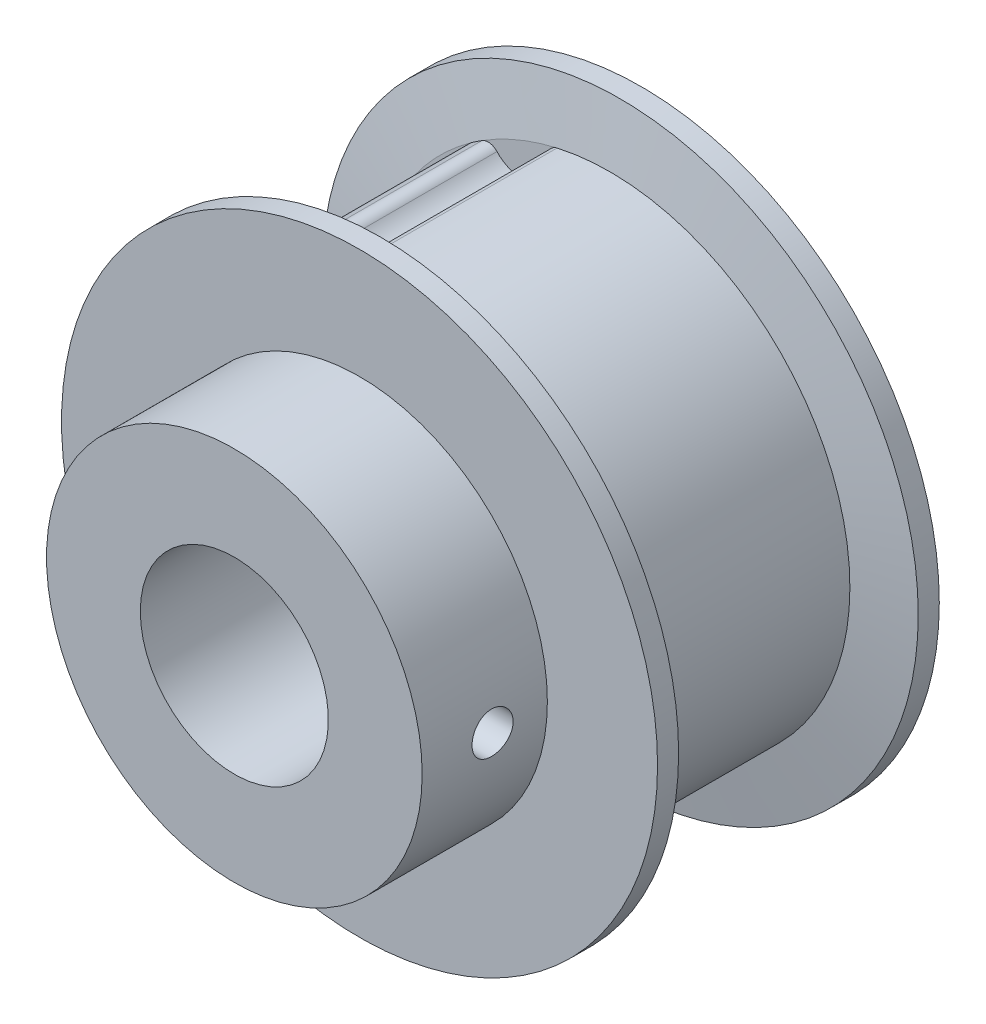
ISO-10303-21;
HEADER;
FILE_DESCRIPTION(('STEP AP214'),'2;1');
FILE_NAME('part.step','',(''),(''),'','','');
FILE_SCHEMA(('AUTOMOTIVE_DESIGN { 1 0 10303 214 1 1 1 1 }'));
ENDSEC;
DATA;
#1=APPLICATION_CONTEXT('core data for automotive mechanical design processes');
#2=APPLICATION_PROTOCOL_DEFINITION('international standard','automotive_design',2000,#1);
#3=PRODUCT_CONTEXT('',#1,'mechanical');
#4=PRODUCT('Part','Part','',(#3));
#5=PRODUCT_RELATED_PRODUCT_CATEGORY('part','',(#4));
#6=PRODUCT_DEFINITION_FORMATION('','',#4);
#7=PRODUCT_DEFINITION_CONTEXT('part definition',#1,'design');
#8=PRODUCT_DEFINITION('design','',#6,#7);
#9=PRODUCT_DEFINITION_SHAPE('','',#8);
#10=(LENGTH_UNIT() NAMED_UNIT(*) SI_UNIT(.MILLI.,.METRE.));
#11=(NAMED_UNIT(*) PLANE_ANGLE_UNIT() SI_UNIT($,.RADIAN.));
#12=(NAMED_UNIT(*) SI_UNIT($,.STERADIAN.) SOLID_ANGLE_UNIT());
#13=UNCERTAINTY_MEASURE_WITH_UNIT(LENGTH_MEASURE(1.E-05),#10,'distance_accuracy_value','');
#14=(GEOMETRIC_REPRESENTATION_CONTEXT(3) GLOBAL_UNCERTAINTY_ASSIGNED_CONTEXT((#13)) GLOBAL_UNIT_ASSIGNED_CONTEXT((#10,
#11,#12)) REPRESENTATION_CONTEXT('',''));
#15=CARTESIAN_POINT('',(0.,0.,0.));
#16=DIRECTION('',(0.,0.,1.));
#17=DIRECTION('',(1.,0.,0.));
#18=AXIS2_PLACEMENT_3D('',#15,#16,#17);
#19=CARTESIAN_POINT('',(0.,0.,13.49375));
#20=DIRECTION('',(0.,0.,1.));
#21=DIRECTION('',(1.,0.,0.));
#22=AXIS2_PLACEMENT_3D('',#19,#20,#21);
#23=PLANE('',#22);
#24=CARTESIAN_POINT('',(0.,0.,13.49375));
#25=DIRECTION('',(0.,0.,-1.));
#26=DIRECTION('',(-1.,0.,0.));
#27=AXIS2_PLACEMENT_3D('',#24,#25,#26);
#28=CIRCLE('',#27,4.76885);
#29=CARTESIAN_POINT('',(-4.76885,0.,13.49375));
#30=VERTEX_POINT('',#29);
#31=EDGE_CURVE('E430',#30,#30,#28,.T.);
#32=ORIENTED_EDGE('',*,*,#31,.T.);
#33=EDGE_LOOP('',(#32));
#34=FACE_BOUND('',#33,.T.);
#35=CARTESIAN_POINT('',(0.,0.,13.49375));
#36=DIRECTION('',(0.,0.,1.));
#37=DIRECTION('',(1.,0.,0.));
#38=AXIS2_PLACEMENT_3D('',#35,#36,#37);
#39=CIRCLE('',#38,9.525);
#40=CARTESIAN_POINT('',(9.525,0.,13.49375));
#41=VERTEX_POINT('',#40);
#42=EDGE_CURVE('E257',#41,#41,#39,.F.);
#43=ORIENTED_EDGE('',*,*,#42,.F.);
#44=EDGE_LOOP('',(#43));
#45=FACE_BOUND('',#44,.T.);
#46=ADVANCED_FACE('F16',(#34,#45),#23,.T.);
#47=CARTESIAN_POINT('',(0.,0.,9.921875));
#48=DIRECTION('',(-1.,0.,0.));
#49=DIRECTION('',(0.,0.,1.));
#50=AXIS2_PLACEMENT_3D('',#47,#48,#49);
#51=CYLINDRICAL_SURFACE('',#50,1.0414);
#52=CARTESIAN_POINT('',(4.76885,0.,8.880475));
#53=CARTESIAN_POINT('',(4.76884852330847,-0.0576985977662349,8.88047783334648));
#54=CARTESIAN_POINT('',(4.76779113617703,-0.115467533123418,8.88529102624313));
#55=CARTESIAN_POINT('',(4.7636714430234,-0.229412794410988,8.90441091337079));
#56=CARTESIAN_POINT('',(4.76060523450025,-0.285585797876013,8.91873608708849));
#57=CARTESIAN_POINT('',(4.7528096560498,-0.394604188509253,8.95641099825753));
#58=CARTESIAN_POINT('',(4.74808281450999,-0.447454491220938,8.97974702161308));
#59=CARTESIAN_POINT('',(4.73747744549021,-0.548471129240607,9.03474411265659));
#60=CARTESIAN_POINT('',(4.73159927002114,-0.596638889479045,9.06640263681796));
#61=CARTESIAN_POINT('',(4.71922840595486,-0.687720111083311,9.13768932718942));
#62=CARTESIAN_POINT('',(4.71272806419331,-0.730547577913806,9.17742605747561));
#63=CARTESIAN_POINT('',(4.69989922363985,-0.808987687584566,9.26350998249827));
#64=CARTESIAN_POINT('',(4.69357074951007,-0.844599299674293,9.30985812003383));
#65=CARTESIAN_POINT('',(4.68172784625236,-0.907969596174088,9.40847706791252));
#66=CARTESIAN_POINT('',(4.6762231292802,-0.935637662620655,9.46080737794415));
#67=CARTESIAN_POINT('',(4.66675985238805,-0.9817538722819,9.56951435714228));
#68=CARTESIAN_POINT('',(4.66280109547798,-1.00020319025624,9.62589050969306));
#69=CARTESIAN_POINT('',(4.6569552161561,-1.02707665450748,9.74016386018618));
#70=CARTESIAN_POINT('',(4.65503691801135,-1.03565183848001,9.79802390989361));
#71=CARTESIAN_POINT('',(4.65339551770343,-1.04300323002775,9.91439084590502));
#72=CARTESIAN_POINT('',(4.6536721497645,-1.04178062397998,9.97289765303889));
#73=CARTESIAN_POINT('',(4.65636112309822,-1.02969272438743,10.0877742118658));
#74=CARTESIAN_POINT('',(4.65873459304935,-1.01900292544007,10.1441634777581));
#75=CARTESIAN_POINT('',(4.66528838620344,-0.988561962019837,10.2543288612698));
#76=CARTESIAN_POINT('',(4.66946882358612,-0.968810224931051,10.3081048135186));
#77=CARTESIAN_POINT('',(4.67920400334399,-0.920644101942968,10.4120117764203));
#78=CARTESIAN_POINT('',(4.68476943248521,-0.892161935123675,10.4621103240891));
#79=CARTESIAN_POINT('',(4.69664043972502,-0.827393269707686,10.556878263446));
#80=CARTESIAN_POINT('',(4.70294606567334,-0.791106266443958,10.6015473037654));
#81=CARTESIAN_POINT('',(4.71575299818434,-0.710835752314663,10.6851952486317));
#82=CARTESIAN_POINT('',(4.722255606314,-0.666704297415194,10.7240321048294));
#83=CARTESIAN_POINT('',(4.73460399425114,-0.572459848968609,10.793793179643));
#84=CARTESIAN_POINT('',(4.74044948754397,-0.522344265715604,10.8247139541441));
#85=CARTESIAN_POINT('',(4.75084460104688,-0.417367303882323,10.8777985495764));
#86=CARTESIAN_POINT('',(4.75539042446044,-0.36249261880154,10.8999367851618));
#87=CARTESIAN_POINT('',(4.762638802077,-0.249749978800202,10.934595695224));
#88=CARTESIAN_POINT('',(4.76534521412753,-0.191888564166974,10.9471365056514));
#89=CARTESIAN_POINT('',(4.76760264695253,-0.111311683540151,10.9575503142808));
#90=CARTESIAN_POINT('',(4.76806932141351,-0.0891092303293494,10.959695152105));
#91=CARTESIAN_POINT('',(4.76869328368904,-0.0446080233390702,10.9625580439646));
#92=CARTESIAN_POINT('',(4.76885057096551,-0.0223092693921756,10.9632760955186));
#93=CARTESIAN_POINT('',(4.76884852330847,0.0576985977662349,10.9632721666535));
#94=CARTESIAN_POINT('',(4.76779113617703,0.115467533123418,10.9584589737569));
#95=CARTESIAN_POINT('',(4.7636714430234,0.229412794410988,10.9393390866292));
#96=CARTESIAN_POINT('',(4.76060523450025,0.285585797876013,10.9250139129115));
#97=CARTESIAN_POINT('',(4.7528096560498,0.394604188509254,10.8873390017425));
#98=CARTESIAN_POINT('',(4.74808281450998,0.44745449122094,10.8640029783869));
#99=CARTESIAN_POINT('',(4.73747744549021,0.548471129240609,10.8090058873434));
#100=CARTESIAN_POINT('',(4.73159927002114,0.596638889479046,10.777347363182));
#101=CARTESIAN_POINT('',(4.71922840595486,0.687720111083311,10.7060606728106));
#102=CARTESIAN_POINT('',(4.71272806419331,0.730547577913807,10.6663239425244));
#103=CARTESIAN_POINT('',(4.69989922363985,0.808987687584567,10.5802400175017));
#104=CARTESIAN_POINT('',(4.69357074951007,0.844599299674294,10.5338918799662));
#105=CARTESIAN_POINT('',(4.68172784625236,0.907969596174089,10.4352729320875));
#106=CARTESIAN_POINT('',(4.67622312928019,0.935637662620656,10.3829426220558));
#107=CARTESIAN_POINT('',(4.66675985238805,0.981753872281901,10.2742356428577));
#108=CARTESIAN_POINT('',(4.66280109547798,1.00020319025624,10.2178594903069));
#109=CARTESIAN_POINT('',(4.6569552161561,1.02707665450748,10.1035861398138));
#110=CARTESIAN_POINT('',(4.65503691801135,1.03565183848001,10.0457260901064));
#111=CARTESIAN_POINT('',(4.65339551770343,1.04300323002775,9.92935915409498));
#112=CARTESIAN_POINT('',(4.6536721497645,1.04178062397998,9.87085234696111));
#113=CARTESIAN_POINT('',(4.65636112309822,1.02969272438743,9.75597578813423));
#114=CARTESIAN_POINT('',(4.65873459304935,1.01900292544007,9.69958652224186));
#115=CARTESIAN_POINT('',(4.66528838620344,0.988561962019837,9.5894211387302));
#116=CARTESIAN_POINT('',(4.66946882358612,0.968810224931051,9.53564518648141));
#117=CARTESIAN_POINT('',(4.67920400334399,0.920644101942968,9.43173822357966));
#118=CARTESIAN_POINT('',(4.68476943248521,0.892161935123675,9.38163967591089));
#119=CARTESIAN_POINT('',(4.69664043972502,0.827393269707686,9.28687173655398));
#120=CARTESIAN_POINT('',(4.70294606567334,0.791106266443958,9.24220269623464));
#121=CARTESIAN_POINT('',(4.71575299818434,0.710835752314663,9.15855475136825));
#122=CARTESIAN_POINT('',(4.722255606314,0.666704297415194,9.11971789517061));
#123=CARTESIAN_POINT('',(4.73460399425114,0.572459848968609,9.04995682035704));
#124=CARTESIAN_POINT('',(4.74044948754397,0.522344265715604,9.01903604585591));
#125=CARTESIAN_POINT('',(4.75084460104688,0.417367303882323,8.96595145042363));
#126=CARTESIAN_POINT('',(4.75539042446044,0.36249261880154,8.94381321483817));
#127=CARTESIAN_POINT('',(4.762638802077,0.249749978800202,8.90915430477605));
#128=CARTESIAN_POINT('',(4.76534521412753,0.191888564166974,8.89661349434864));
#129=CARTESIAN_POINT('',(4.76760264695253,0.111311683540151,8.88619968571916));
#130=CARTESIAN_POINT('',(4.76806932141351,0.0891092303293492,8.88405484789503));
#131=CARTESIAN_POINT('',(4.76869328368904,0.0446080233390703,8.8811919560354));
#132=CARTESIAN_POINT('',(4.76885057096551,0.0223092693921757,8.88047390448135));
#133=CARTESIAN_POINT('',(4.76885,0.,8.880475));
#134=B_SPLINE_CURVE_WITH_KNOTS('',3,(#52,#53,#54,#55,#56,#57,#58,#59,#60,#61,#62,#63,#64,#65,
#66,#67,#68,#69,#70,#71,#72,#73,#74,#75,#76,#77,#78,#79,#80,#81,#82,#83,#84,#85,#86,#87,#88,#89,
#90,#91,#92,#93,#94,#95,#96,#97,#98,#99,#100,#101,#102,#103,#104,#105,#106,#107,#108,#109,#110,
#111,#112,#113,#114,#115,#116,#117,#118,#119,#120,#121,#122,#123,#124,#125,#126,#127,#128,#129,
#130,#131,#132,#133),.UNSPECIFIED.,.T.,.F.,(4,2,2,2,2,2,2,2,2,2,2,2,2,2,2,2,2,2,2,2,2,2,2,2,2,2,
2,2,2,2,2,2,2,2,2,2,2,2,2,2,4),(0.,0.173010416635859,0.346357938104146,0.519442665986896,
0.692474557008029,0.868007080836766,1.04356466100289,1.22105188557719,1.39851648690266,
1.57322888537201,1.74792012890324,1.91943933661092,2.09096938395979,2.2638664077814,
2.43677461462704,2.61337902633212,2.79006014468995,2.967252256972,3.14407158301989,
3.2109662638097,3.27786106094185,3.45087147757771,3.624218999046,3.79730372692875,
3.97033561794988,4.14586814177862,4.32142572194474,4.49891294651904,4.67637754784452,
4.85108994631387,5.0257811898451,5.19730039755278,5.36883044490165,5.54172746872326,
5.71463567556889,5.89124008727397,6.06792120563181,6.24511331791386,6.42193264396174,
6.48882732475156,6.55572212188371),.UNSPECIFIED.);
#135=CARTESIAN_POINT('',(4.76885,0.,8.880475));
#136=VERTEX_POINT('',#135);
#137=EDGE_CURVE('E19',#136,#136,#134,.T.);
#138=ORIENTED_EDGE('',*,*,#137,.T.);
#139=EDGE_LOOP('',(#138));
#140=FACE_BOUND('',#139,.T.);
#141=CARTESIAN_POINT('',(9.525,0.,10.963275));
#142=CARTESIAN_POINT('',(9.52499884639291,0.0582735292877629,10.9632703283392));
#143=CARTESIAN_POINT('',(9.52445933936864,0.116595322619603,10.9583657462391));
#144=CARTESIAN_POINT('',(9.52235688032514,0.231674615958853,10.9388603132041));
#145=CARTESIAN_POINT('',(9.52079178568485,0.288428581251985,10.9242391618529));
#146=CARTESIAN_POINT('',(9.51681512818299,0.398610716462479,10.8857338292278));
#147=CARTESIAN_POINT('',(9.51440442439465,0.452042197152047,10.861859046351));
#148=CARTESIAN_POINT('',(9.50900607943094,0.554115245606015,10.8055419729624));
#149=CARTESIAN_POINT('',(9.50601868600653,0.602758856780225,10.773103359356));
#150=CARTESIAN_POINT('',(9.49978626741521,0.694113585429947,10.7004250789522));
#151=CARTESIAN_POINT('',(9.4965402846776,0.736800873572002,10.6601555379607));
#152=CARTESIAN_POINT('',(9.49016425329055,0.814827559109186,10.5730206194688));
#153=CARTESIAN_POINT('',(9.48703421590986,0.850166243823228,10.5261546029686));
#154=CARTESIAN_POINT('',(9.4812353245689,0.912573290224957,10.4270119986482));
#155=CARTESIAN_POINT('',(9.47856765765727,0.93962049790762,10.3747220196864));
#156=CARTESIAN_POINT('',(9.47400738878788,0.984541426813792,10.2663088138172));
#157=CARTESIAN_POINT('',(9.4721147573862,1.00241549653528,10.2101857326255));
#158=CARTESIAN_POINT('',(9.46932745871274,1.0284135860093,10.0959376370461));
#159=CARTESIAN_POINT('',(9.46842882035886,1.03657641291381,10.037821552076));
#160=CARTESIAN_POINT('',(9.46771900124972,1.04304030312059,9.92103776293238));
#161=CARTESIAN_POINT('',(9.46790778857706,1.04134165587035,9.86237007499956));
#162=CARTESIAN_POINT('',(9.46934785721121,1.02816278176514,9.74641761833394));
#163=CARTESIAN_POINT('',(9.47059451212957,1.01672514582905,9.68912794324888));
#164=CARTESIAN_POINT('',(9.47400264649458,0.984459128926173,9.57728563967636));
#165=CARTESIAN_POINT('',(9.47616414869426,0.96363051439681,9.52273307930106));
#166=CARTESIAN_POINT('',(9.48116381762611,0.913126360227213,9.41777858563978));
#167=CARTESIAN_POINT('',(9.48400343954042,0.883431760228055,9.36738589636309));
#168=CARTESIAN_POINT('',(9.49003790511303,0.816054943773715,9.27228736899015));
#169=CARTESIAN_POINT('',(9.49323273206631,0.778373102876901,9.22758126367003));
#170=CARTESIAN_POINT('',(9.49963783803421,0.695861448725414,9.14488072390628));
#171=CARTESIAN_POINT('',(9.50284811298077,0.650996249503975,9.10692158792468));
#172=CARTESIAN_POINT('',(9.50890863475555,0.555488462772246,9.03905031141228));
#173=CARTESIAN_POINT('',(9.51175871514799,0.504843224888206,9.00914188372794));
#174=CARTESIAN_POINT('',(9.51677936130814,0.399169316534392,8.95822404776294));
#175=CARTESIAN_POINT('',(9.51894921472695,0.344136126026761,8.93722396042425));
#176=CARTESIAN_POINT('',(9.52235521284579,0.231386038017177,8.90481923855413));
#177=CARTESIAN_POINT('',(9.52359333607432,0.173675105144426,8.89339426537073));
#178=CARTESIAN_POINT('',(9.52476564503519,0.0771251617079257,8.88261573509716));
#179=CARTESIAN_POINT('',(9.52500076361025,0.0385731544175606,8.88047190767498));
#180=CARTESIAN_POINT('',(9.52499884639291,-0.0582735292877636,8.88047967166077));
#181=CARTESIAN_POINT('',(9.52445933936864,-0.116595322619604,8.88538425376087));
#182=CARTESIAN_POINT('',(9.52235688032514,-0.231674615958854,8.90488968679589));
#183=CARTESIAN_POINT('',(9.52079178568485,-0.288428581251986,8.91951083814708));
#184=CARTESIAN_POINT('',(9.51681512818299,-0.39861071646248,8.95801617077216));
#185=CARTESIAN_POINT('',(9.51440442439465,-0.452042197152048,8.98189095364897));
#186=CARTESIAN_POINT('',(9.50900607943094,-0.554115245606016,9.03820802703758));
#187=CARTESIAN_POINT('',(9.50601868600653,-0.602758856780226,9.07064664064402));
#188=CARTESIAN_POINT('',(9.49978626741521,-0.694113585429948,9.14332492104782));
#189=CARTESIAN_POINT('',(9.4965402846776,-0.736800873572002,9.18359446203933));
#190=CARTESIAN_POINT('',(9.49016425329055,-0.814827559109186,9.27072938053116));
#191=CARTESIAN_POINT('',(9.48703421590986,-0.850166243823228,9.31759539703144));
#192=CARTESIAN_POINT('',(9.4812353245689,-0.912573290224956,9.41673800135184));
#193=CARTESIAN_POINT('',(9.47856765765727,-0.93962049790762,9.46902798031357));
#194=CARTESIAN_POINT('',(9.47400738878788,-0.984541426813792,9.57744118618277));
#195=CARTESIAN_POINT('',(9.4721147573862,-1.00241549653528,9.63356426737452));
#196=CARTESIAN_POINT('',(9.46932745871274,-1.0284135860093,9.74781236295391));
#197=CARTESIAN_POINT('',(9.46842882035886,-1.03657641291381,9.80592844792398));
#198=CARTESIAN_POINT('',(9.46771900124972,-1.04304030312059,9.92271223706762));
#199=CARTESIAN_POINT('',(9.46790778857706,-1.04134165587035,9.98137992500044));
#200=CARTESIAN_POINT('',(9.46934785721121,-1.02816278176514,10.0973323816661));
#201=CARTESIAN_POINT('',(9.47059451212957,-1.01672514582905,10.1546220567511));
#202=CARTESIAN_POINT('',(9.47400264649458,-0.984459128926173,10.2664643603236));
#203=CARTESIAN_POINT('',(9.47616414869426,-0.96363051439681,10.3210169206989));
#204=CARTESIAN_POINT('',(9.48116381762611,-0.913126360227212,10.4259714143602));
#205=CARTESIAN_POINT('',(9.48400343954042,-0.883431760228054,10.4763641036369));
#206=CARTESIAN_POINT('',(9.49003790511303,-0.816054943773715,10.5714626310099));
#207=CARTESIAN_POINT('',(9.49323273206631,-0.7783731028769,10.61616873633));
#208=CARTESIAN_POINT('',(9.49963783803421,-0.695861448725414,10.6988692760937));
#209=CARTESIAN_POINT('',(9.50284811298077,-0.650996249503975,10.7368284120753));
#210=CARTESIAN_POINT('',(9.50890863475556,-0.555488462772245,10.8046996885877));
#211=CARTESIAN_POINT('',(9.51175871514799,-0.504843224888204,10.8346081162721));
#212=CARTESIAN_POINT('',(9.51677936130814,-0.399169316534392,10.8855259522371));
#213=CARTESIAN_POINT('',(9.51894921472695,-0.344136126026761,10.9065260395757));
#214=CARTESIAN_POINT('',(9.52235521284579,-0.231386038017177,10.9389307614459));
#215=CARTESIAN_POINT('',(9.52359333607432,-0.173675105144426,10.9503557346293));
#216=CARTESIAN_POINT('',(9.52476564503519,-0.0771251617079251,10.9611342649028));
#217=CARTESIAN_POINT('',(9.52500076361025,-0.0385731544175606,10.963278092325));
#218=CARTESIAN_POINT('',(9.525,0.,10.963275));
#219=B_SPLINE_CURVE_WITH_KNOTS('',3,(#141,#142,#143,#144,#145,#146,#147,#148,#149,#150,#151,
#152,#153,#154,#155,#156,#157,#158,#159,#160,#161,#162,#163,#164,#165,#166,#167,#168,#169,#170,
#171,#172,#173,#174,#175,#176,#177,#178,#179,#180,#181,#182,#183,#184,#185,#186,#187,#188,#189,
#190,#191,#192,#193,#194,#195,#196,#197,#198,#199,#200,#201,#202,#203,#204,#205,#206,#207,#208,
#209,#210,#211,#212,#213,#214,#215,#216,#217,#218),.UNSPECIFIED.,.T.,.F.,(4,2,2,2,2,2,2,2,2,2,2,
2,2,2,2,2,2,2,2,2,2,2,2,2,2,2,2,2,2,2,2,2,2,2,2,2,2,2,4),(0.,0.174697504555782,
0.349761149509179,0.524647456045276,0.699458796416707,0.874950592016937,1.05045939920521,
1.22641232444646,1.40235856454042,1.57759931756628,1.75283492706693,1.92730810237599,
2.1017856172385,2.27664096348019,2.4514880898838,2.62722464671059,2.80304211185694,
2.97904308663591,3.15466926056693,3.27030725095389,3.44500475550967,3.62006840046307,
3.79495470699917,3.9697660473706,4.14525784297083,4.3207666501591,4.49671957540035,
4.67266581549431,4.84790656852018,5.02314217802082,5.19761535332988,5.37209286819239,
5.54694821443409,5.72179534083769,5.89753189766448,6.07334936281083,6.2493503375898,
6.42497651152082,6.54061450190778),.UNSPECIFIED.);
#220=CARTESIAN_POINT('',(9.525,0.,10.963275));
#221=VERTEX_POINT('',#220);
#222=EDGE_CURVE('E134',#221,#221,#219,.T.);
#223=ORIENTED_EDGE('',*,*,#222,.F.);
#224=EDGE_LOOP('',(#223));
#225=FACE_BOUND('',#224,.T.);
#226=ADVANCED_FACE('F258',(#140,#225),#51,.F.);
#227=CARTESIAN_POINT('',(0.,0.,-6.68335779755536));
#228=DIRECTION('',(0.,0.,1.));
#229=DIRECTION('',(1.,0.,0.));
#230=AXIS2_PLACEMENT_3D('',#227,#228,#229);
#231=CYLINDRICAL_SURFACE('',#230,12.1666);
#232=DIRECTION('',(0.,0.,1.));
#233=VECTOR('',#232,1.);
#234=CARTESIAN_POINT('',(-7.02165854602421,9.93591801611919,5.55625));
#235=LINE('',#234,#233);
#236=CARTESIAN_POINT('',(-7.02165854760629,9.93591801500195,5.55625));
#237=VERTEX_POINT('',#236);
#238=CARTESIAN_POINT('',(-7.02165854760595,9.93591801500147,-5.55625));
#239=VERTEX_POINT('',#238);
#240=EDGE_CURVE('E152',#237,#239,#235,.F.);
#241=ORIENTED_EDGE('',*,*,#240,.F.);
#242=CARTESIAN_POINT('',(0.,0.,5.55625));
#243=DIRECTION('',(0.,0.,1.));
#244=DIRECTION('',(1.,0.,0.));
#245=AXIS2_PLACEMENT_3D('',#242,#243,#244);
#246=CIRCLE('',#245,12.1666);
#247=CARTESIAN_POINT('',(-6.49251889687736,10.2894778260945,5.55624999999988));
#248=VERTEX_POINT('',#247);
#249=EDGE_CURVE('E140',#237,#248,#246,.F.);
#250=ORIENTED_EDGE('',*,*,#249,.T.);
#251=DIRECTION('',(0.,0.,1.));
#252=VECTOR('',#251,1.);
#253=CARTESIAN_POINT('',(-6.49251889851464,10.2894778250614,5.55625));
#254=LINE('',#253,#252);
#255=CARTESIAN_POINT('',(-6.49251889687737,10.2894778260945,-5.55625));
#256=VERTEX_POINT('',#255);
#257=EDGE_CURVE('E149',#256,#248,#254,.T.);
#258=ORIENTED_EDGE('',*,*,#257,.F.);
#259=CARTESIAN_POINT('',(0.,0.,-5.55625));
#260=DIRECTION('',(0.,0.,1.));
#261=DIRECTION('',(1.,0.,0.));
#262=AXIS2_PLACEMENT_3D('',#259,#260,#261);
#263=CIRCLE('',#262,12.1666);
#264=EDGE_CURVE('E155',#256,#239,#263,.T.);
#265=ORIENTED_EDGE('',*,*,#264,.T.);
#266=EDGE_LOOP('',(#241,#250,#258,#265));
#267=FACE_BOUND('',#266,.T.);
#268=ADVANCED_FACE('F148',(#267),#231,.T.);
#269=CARTESIAN_POINT('',(0.,0.,-6.68335779755536));
#270=DIRECTION('',(0.,0.,1.));
#271=DIRECTION('',(1.,0.,0.));
#272=AXIS2_PLACEMENT_3D('',#269,#270,#271);
#273=CYLINDRICAL_SURFACE('',#272,12.1666);
#274=CARTESIAN_POINT('',(0.,0.,-5.55625));
#275=DIRECTION('',(0.,0.,1.));
#276=DIRECTION('',(1.,0.,0.));
#277=AXIS2_PLACEMENT_3D('',#274,#275,#276);
#278=CIRCLE('',#277,12.1666);
#279=CARTESIAN_POINT('',(-9.93591801500255,7.02165854760577,-5.55625000000001));
#280=VERTEX_POINT('',#279);
#281=CARTESIAN_POINT('',(-10.2894778260945,6.49251889687736,-5.55625));
#282=VERTEX_POINT('',#281);
#283=EDGE_CURVE('E388',#280,#282,#278,.T.);
#284=ORIENTED_EDGE('',*,*,#283,.T.);
#285=DIRECTION('',(0.,0.,1.));
#286=VECTOR('',#285,1.);
#287=CARTESIAN_POINT('',(-10.2894778250614,6.49251889851464,5.55625));
#288=LINE('',#287,#286);
#289=CARTESIAN_POINT('',(-10.2894778260945,6.49251889687736,5.55625));
#290=VERTEX_POINT('',#289);
#291=EDGE_CURVE('E244',#290,#282,#288,.F.);
#292=ORIENTED_EDGE('',*,*,#291,.F.);
#293=CARTESIAN_POINT('',(0.,0.,5.55625));
#294=DIRECTION('',(0.,0.,1.));
#295=DIRECTION('',(1.,0.,0.));
#296=AXIS2_PLACEMENT_3D('',#293,#294,#295);
#297=CIRCLE('',#296,12.1666);
#298=CARTESIAN_POINT('',(-9.93591801500313,7.02165854760618,5.55625000000001));
#299=VERTEX_POINT('',#298);
#300=EDGE_CURVE('E154',#290,#299,#297,.F.);
#301=ORIENTED_EDGE('',*,*,#300,.T.);
#302=DIRECTION('',(0.,0.,1.));
#303=VECTOR('',#302,1.);
#304=CARTESIAN_POINT('',(-9.93591801612047,7.02165854602512,5.55625));
#305=LINE('',#304,#303);
#306=EDGE_CURVE('E165',#280,#299,#305,.T.);
#307=ORIENTED_EDGE('',*,*,#306,.F.);
#308=EDGE_LOOP('',(#284,#292,#301,#307));
#309=FACE_BOUND('',#308,.T.);
#310=ADVANCED_FACE('F271',(#309),#273,.T.);
#311=CARTESIAN_POINT('',(0.,0.,13.49375));
#312=DIRECTION('',(0.,0.,-1.));
#313=DIRECTION('',(-1.,0.,0.));
#314=AXIS2_PLACEMENT_3D('',#311,#312,#313);
#315=CYLINDRICAL_SURFACE('',#314,4.76885);
#316=ORIENTED_EDGE('',*,*,#31,.F.);
#317=EDGE_LOOP('',(#316));
#318=FACE_BOUND('',#317,.T.);
#319=CARTESIAN_POINT('',(0.,0.,-7.14375));
#320=DIRECTION('',(0.,0.,-1.));
#321=DIRECTION('',(-1.,0.,0.));
#322=AXIS2_PLACEMENT_3D('',#319,#320,#321);
#323=CIRCLE('',#322,4.76885);
#324=CARTESIAN_POINT('',(-4.76885,0.,-7.14375));
#325=VERTEX_POINT('',#324);
#326=EDGE_CURVE('E236',#325,#325,#323,.T.);
#327=ORIENTED_EDGE('',*,*,#326,.T.);
#328=EDGE_LOOP('',(#327));
#329=FACE_BOUND('',#328,.T.);
#330=ORIENTED_EDGE('',*,*,#137,.F.);
#331=EDGE_LOOP('',(#330));
#332=FACE_BOUND('',#331,.T.);
#333=ADVANCED_FACE('F265',(#318,#329,#332),#315,.F.);
#334=CARTESIAN_POINT('',(0.,0.,7.14375));
#335=DIRECTION('',(0.,0.,1.));
#336=DIRECTION('',(1.,0.,0.));
#337=AXIS2_PLACEMENT_3D('',#334,#335,#336);
#338=CYLINDRICAL_SURFACE('',#337,9.525);
#339=CARTESIAN_POINT('',(0.,0.,7.14375));
#340=DIRECTION('',(0.,0.,1.));
#341=DIRECTION('',(1.,0.,0.));
#342=AXIS2_PLACEMENT_3D('',#339,#340,#341);
#343=CIRCLE('',#342,9.525);
#344=CARTESIAN_POINT('',(9.525,0.,7.14375));
#345=VERTEX_POINT('',#344);
#346=EDGE_CURVE('E232',#345,#345,#343,.F.);
#347=ORIENTED_EDGE('',*,*,#346,.F.);
#348=EDGE_LOOP('',(#347));
#349=FACE_BOUND('',#348,.T.);
#350=ORIENTED_EDGE('',*,*,#42,.T.);
#351=EDGE_LOOP('',(#350));
#352=FACE_BOUND('',#351,.T.);
#353=ORIENTED_EDGE('',*,*,#222,.T.);
#354=EDGE_LOOP('',(#353));
#355=FACE_BOUND('',#354,.T.);
#356=ADVANCED_FACE('F261',(#349,#352,#355),#338,.T.);
#357=CARTESIAN_POINT('',(-6.17263696219694,9.78252234336932,5.55625));
#358=DIRECTION('',(0.,0.,1.));
#359=DIRECTION('',(1.,0.,0.));
#360=AXIS2_PLACEMENT_3D('',#357,#358,#359);
#361=CYLINDRICAL_SURFACE('',#360,0.59944);
#362=CARTESIAN_POINT('',(-6.17263696219694,9.78252234336932,-5.55625));
#363=DIRECTION('',(0.,0.,1.));
#364=DIRECTION('',(1.,0.,0.));
#365=AXIS2_PLACEMENT_3D('',#362,#363,#364);
#366=CIRCLE('',#365,0.59944);
#367=CARTESIAN_POINT('',(-5.73081099550388,10.1876373008272,-5.55625));
#368=VERTEX_POINT('',#367);
#369=EDGE_CURVE('E133',#368,#256,#366,.T.);
#370=ORIENTED_EDGE('',*,*,#369,.T.);
#371=ORIENTED_EDGE('',*,*,#257,.T.);
#372=CARTESIAN_POINT('',(-6.17263696219694,9.78252234336932,5.55625));
#373=DIRECTION('',(0.,0.,1.));
#374=DIRECTION('',(1.,0.,0.));
#375=AXIS2_PLACEMENT_3D('',#372,#373,#374);
#376=CIRCLE('',#375,0.59944);
#377=CARTESIAN_POINT('',(-5.73081099550388,10.1876373008272,5.55625));
#378=VERTEX_POINT('',#377);
#379=EDGE_CURVE('E121',#248,#378,#376,.F.);
#380=ORIENTED_EDGE('',*,*,#379,.T.);
#381=DIRECTION('',(0.,0.,1.));
#382=VECTOR('',#381,1.);
#383=CARTESIAN_POINT('',(-5.73081099550388,10.1876373008276,5.55625));
#384=LINE('',#383,#382);
#385=EDGE_CURVE('E235',#378,#368,#384,.F.);
#386=ORIENTED_EDGE('',*,*,#385,.T.);
#387=EDGE_LOOP('',(#370,#371,#380,#386));
#388=FACE_BOUND('',#387,.T.);
#389=ADVANCED_FACE('F157',(#388),#361,.T.);
#390=CARTESIAN_POINT('',(-9.4463821785466,6.67570626993744,5.55625));
#391=DIRECTION('',(0.,0.,1.));
#392=DIRECTION('',(1.,0.,0.));
#393=AXIS2_PLACEMENT_3D('',#390,#391,#392);
#394=CYLINDRICAL_SURFACE('',#393,0.599439999999492);
#395=CARTESIAN_POINT('',(-9.4463821785466,6.67570626993744,-5.55625));
#396=DIRECTION('',(0.,0.,1.));
#397=DIRECTION('',(1.,0.,0.));
#398=AXIS2_PLACEMENT_3D('',#395,#396,#397);
#399=CIRCLE('',#398,0.599439999999492);
#400=CARTESIAN_POINT('',(-9.19321899340858,7.21906316488769,-5.55625));
#401=VERTEX_POINT('',#400);
#402=EDGE_CURVE('E160',#401,#280,#399,.T.);
#403=ORIENTED_EDGE('',*,*,#402,.T.);
#404=ORIENTED_EDGE('',*,*,#306,.T.);
#405=CARTESIAN_POINT('',(-9.4463821785466,6.67570626993744,5.55625));
#406=DIRECTION('',(0.,0.,1.));
#407=DIRECTION('',(1.,0.,0.));
#408=AXIS2_PLACEMENT_3D('',#405,#406,#407);
#409=CIRCLE('',#408,0.599439999999492);
#410=CARTESIAN_POINT('',(-9.19321899340858,7.21906316488769,5.55625));
#411=VERTEX_POINT('',#410);
#412=EDGE_CURVE('E158',#299,#411,#409,.F.);
#413=ORIENTED_EDGE('',*,*,#412,.T.);
#414=DIRECTION('',(0.,0.,1.));
#415=VECTOR('',#414,1.);
#416=CARTESIAN_POINT('',(-9.19321899340851,7.21906316488749,5.55625));
#417=LINE('',#416,#415);
#418=EDGE_CURVE('E381',#411,#401,#417,.F.);
#419=ORIENTED_EDGE('',*,*,#418,.T.);
#420=EDGE_LOOP('',(#403,#404,#413,#419));
#421=FACE_BOUND('',#420,.T.);
#422=ADVANCED_FACE('F370',(#421),#394,.T.);
#423=CARTESIAN_POINT('',(-6.67570626993744,9.44638217854406,5.55625));
#424=DIRECTION('',(0.,0.,1.));
#425=DIRECTION('',(1.,0.,0.));
#426=AXIS2_PLACEMENT_3D('',#423,#424,#425);
#427=CYLINDRICAL_SURFACE('',#426,0.59944);
#428=DIRECTION('',(0.,0.,1.));
#429=VECTOR('',#428,1.);
#430=CARTESIAN_POINT('',(-7.21906316488842,9.19321899340807,5.55625));
#431=LINE('',#430,#429);
#432=CARTESIAN_POINT('',(-7.21906316488857,9.19321899340738,-5.55625));
#433=VERTEX_POINT('',#432);
#434=CARTESIAN_POINT('',(-7.21906316488857,9.19321899340738,5.55625));
#435=VERTEX_POINT('',#434);
#436=EDGE_CURVE('E412',#433,#435,#431,.T.);
#437=ORIENTED_EDGE('',*,*,#436,.T.);
#438=CARTESIAN_POINT('',(-6.67570626993744,9.44638217854406,5.55625));
#439=DIRECTION('',(0.,0.,1.));
#440=DIRECTION('',(1.,0.,0.));
#441=AXIS2_PLACEMENT_3D('',#438,#439,#440);
#442=CIRCLE('',#441,0.59944);
#443=EDGE_CURVE('E245',#435,#237,#442,.F.);
#444=ORIENTED_EDGE('',*,*,#443,.T.);
#445=ORIENTED_EDGE('',*,*,#240,.T.);
#446=CARTESIAN_POINT('',(-6.67570626993744,9.44638217854406,-5.55625));
#447=DIRECTION('',(0.,0.,1.));
#448=DIRECTION('',(1.,0.,0.));
#449=AXIS2_PLACEMENT_3D('',#446,#447,#448);
#450=CIRCLE('',#449,0.59944);
#451=EDGE_CURVE('E248',#239,#433,#450,.T.);
#452=ORIENTED_EDGE('',*,*,#451,.T.);
#453=EDGE_LOOP('',(#437,#444,#445,#452));
#454=FACE_BOUND('',#453,.T.);
#455=ADVANCED_FACE('F367',(#454),#427,.T.);
#456=CARTESIAN_POINT('',(-9.78252234336932,6.17263696219694,5.55625));
#457=DIRECTION('',(0.,0.,1.));
#458=DIRECTION('',(1.,0.,0.));
#459=AXIS2_PLACEMENT_3D('',#456,#457,#458);
#460=CYLINDRICAL_SURFACE('',#459,0.59944);
#461=DIRECTION('',(0.,0.,1.));
#462=VECTOR('',#461,1.);
#463=CARTESIAN_POINT('',(-10.1876373008276,5.73081099550388,5.55625));
#464=LINE('',#463,#462);
#465=CARTESIAN_POINT('',(-10.1876373008272,5.73081099550388,-5.55625));
#466=VERTEX_POINT('',#465);
#467=CARTESIAN_POINT('',(-10.1876373008272,5.73081099550388,5.55625));
#468=VERTEX_POINT('',#467);
#469=EDGE_CURVE('E231',#466,#468,#464,.T.);
#470=ORIENTED_EDGE('',*,*,#469,.T.);
#471=CARTESIAN_POINT('',(-9.78252234336932,6.17263696219694,5.55625));
#472=DIRECTION('',(0.,0.,1.));
#473=DIRECTION('',(1.,0.,0.));
#474=AXIS2_PLACEMENT_3D('',#471,#472,#473);
#475=CIRCLE('',#474,0.59944);
#476=EDGE_CURVE('E239',#468,#290,#475,.F.);
#477=ORIENTED_EDGE('',*,*,#476,.T.);
#478=ORIENTED_EDGE('',*,*,#291,.T.);
#479=CARTESIAN_POINT('',(-9.78252234336932,6.17263696219694,-5.55625));
#480=DIRECTION('',(0.,0.,1.));
#481=DIRECTION('',(1.,0.,0.));
#482=AXIS2_PLACEMENT_3D('',#479,#480,#481);
#483=CIRCLE('',#482,0.59944);
#484=EDGE_CURVE('E242',#282,#466,#483,.T.);
#485=ORIENTED_EDGE('',*,*,#484,.T.);
#486=EDGE_LOOP('',(#470,#477,#478,#485));
#487=FACE_BOUND('',#486,.T.);
#488=ADVANCED_FACE('F363',(#487),#460,.T.);
#489=CARTESIAN_POINT('',(0.,0.,-7.14375));
#490=DIRECTION('',(0.,0.,1.));
#491=DIRECTION('',(1.,0.,0.));
#492=AXIS2_PLACEMENT_3D('',#489,#490,#491);
#493=PLANE('',#492);
#494=ORIENTED_EDGE('',*,*,#326,.F.);
#495=EDGE_LOOP('',(#494));
#496=FACE_BOUND('',#495,.T.);
#497=CARTESIAN_POINT('',(0.,0.,-7.14375));
#498=DIRECTION('',(0.,0.,1.));
#499=DIRECTION('',(1.,0.,0.));
#500=AXIS2_PLACEMENT_3D('',#497,#498,#499);
#501=CIRCLE('',#500,15.113);
#502=CARTESIAN_POINT('',(15.113,0.,-7.14375));
#503=VERTEX_POINT('',#502);
#504=EDGE_CURVE('E216',#503,#503,#501,.T.);
#505=ORIENTED_EDGE('',*,*,#504,.F.);
#506=EDGE_LOOP('',(#505));
#507=FACE_BOUND('',#506,.T.);
#508=ADVANCED_FACE('F359',(#496,#507),#493,.F.);
#509=CARTESIAN_POINT('',(0.,0.,7.14375));
#510=DIRECTION('',(0.,0.,1.));
#511=DIRECTION('',(1.,0.,0.));
#512=AXIS2_PLACEMENT_3D('',#509,#510,#511);
#513=PLANE('',#512);
#514=ORIENTED_EDGE('',*,*,#346,.T.);
#515=EDGE_LOOP('',(#514));
#516=FACE_BOUND('',#515,.T.);
#517=CARTESIAN_POINT('',(0.,0.,7.14375));
#518=DIRECTION('',(0.,0.,1.));
#519=DIRECTION('',(1.,0.,0.));
#520=AXIS2_PLACEMENT_3D('',#517,#518,#519);
#521=CIRCLE('',#520,15.113);
#522=CARTESIAN_POINT('',(15.113,0.,7.14375));
#523=VERTEX_POINT('',#522);
#524=EDGE_CURVE('E204',#523,#523,#521,.F.);
#525=ORIENTED_EDGE('',*,*,#524,.F.);
#526=EDGE_LOOP('',(#525));
#527=FACE_BOUND('',#526,.T.);
#528=ADVANCED_FACE('F355',(#516,#527),#513,.T.);
#529=CARTESIAN_POINT('',(-4.47834670856426,11.3360352098908,5.55625));
#530=DIRECTION('',(0.,0.,1.));
#531=DIRECTION('',(1.,0.,0.));
#532=AXIS2_PLACEMENT_3D('',#529,#530,#531);
#533=CYLINDRICAL_SURFACE('',#532,1.69926);
#534=CARTESIAN_POINT('',(-4.47834670856426,11.3360352098908,-5.55625));
#535=DIRECTION('',(0.,0.,1.));
#536=DIRECTION('',(1.,0.,0.));
#537=AXIS2_PLACEMENT_3D('',#534,#535,#536);
#538=CIRCLE('',#537,1.69926);
#539=CARTESIAN_POINT('',(-4.01800353801222,9.70031863513625,-5.55625));
#540=VERTEX_POINT('',#539);
#541=EDGE_CURVE('E222',#368,#540,#538,.T.);
#542=ORIENTED_EDGE('',*,*,#541,.F.);
#543=ORIENTED_EDGE('',*,*,#385,.F.);
#544=CARTESIAN_POINT('',(-4.47834670856426,11.3360352098908,5.55625));
#545=DIRECTION('',(0.,0.,1.));
#546=DIRECTION('',(1.,0.,0.));
#547=AXIS2_PLACEMENT_3D('',#544,#545,#546);
#548=CIRCLE('',#547,1.69926);
#549=CARTESIAN_POINT('',(-4.01800353801222,9.70031863513625,5.55625));
#550=VERTEX_POINT('',#549);
#551=EDGE_CURVE('E128',#378,#550,#548,.T.);
#552=ORIENTED_EDGE('',*,*,#551,.T.);
#553=DIRECTION('',(0.,0.,1.));
#554=VECTOR('',#553,1.);
#555=CARTESIAN_POINT('',(-4.01800353801309,9.70031863513576,5.55625));
#556=LINE('',#555,#554);
#557=EDGE_CURVE('E210',#550,#540,#556,.F.);
#558=ORIENTED_EDGE('',*,*,#557,.T.);
#559=EDGE_LOOP('',(#542,#543,#552,#558));
#560=FACE_BOUND('',#559,.T.);
#561=ADVANCED_FACE('F351',(#560),#533,.F.);
#562=CARTESIAN_POINT('',(-8.47556572706426,8.75934182048884,5.55625));
#563=DIRECTION('',(0.,0.,1.));
#564=DIRECTION('',(1.,0.,0.));
#565=AXIS2_PLACEMENT_3D('',#562,#563,#564);
#566=CYLINDRICAL_SURFACE('',#565,1.69925999999873);
#567=CARTESIAN_POINT('',(-8.47556572706426,8.75934182048884,-5.55625));
#568=DIRECTION('',(0.,0.,1.));
#569=DIRECTION('',(1.,0.,0.));
#570=AXIS2_PLACEMENT_3D('',#567,#568,#569);
#571=CIRCLE('',#570,1.69925999999873);
#572=CARTESIAN_POINT('',(-7.4243024606594,7.42430246065598,-5.55625));
#573=VERTEX_POINT('',#572);
#574=EDGE_CURVE('E228',#401,#573,#571,.T.);
#575=ORIENTED_EDGE('',*,*,#574,.F.);
#576=ORIENTED_EDGE('',*,*,#418,.F.);
#577=CARTESIAN_POINT('',(-8.47556572706426,8.75934182048884,5.55625));
#578=DIRECTION('',(0.,0.,1.));
#579=DIRECTION('',(1.,0.,0.));
#580=AXIS2_PLACEMENT_3D('',#577,#578,#579);
#581=CIRCLE('',#580,1.69925999999873);
#582=CARTESIAN_POINT('',(-7.4243024606594,7.42430246065598,5.55625));
#583=VERTEX_POINT('',#582);
#584=EDGE_CURVE('E199',#411,#583,#581,.T.);
#585=ORIENTED_EDGE('',*,*,#584,.T.);
#586=DIRECTION('',(0.,0.,1.));
#587=VECTOR('',#586,1.);
#588=CARTESIAN_POINT('',(-7.42430246065898,7.4243024606565,5.55625));
#589=LINE('',#588,#587);
#590=EDGE_CURVE('E415',#583,#573,#589,.F.);
#591=ORIENTED_EDGE('',*,*,#590,.T.);
#592=EDGE_LOOP('',(#575,#576,#585,#591));
#593=FACE_BOUND('',#592,.T.);
#594=ADVANCED_FACE('F347',(#593),#566,.F.);
#595=CARTESIAN_POINT('',(-8.75934182049138,8.47556572706426,5.55625));
#596=DIRECTION('',(0.,0.,1.));
#597=DIRECTION('',(1.,0.,0.));
#598=AXIS2_PLACEMENT_3D('',#595,#596,#597);
#599=CYLINDRICAL_SURFACE('',#598,1.69926);
#600=CARTESIAN_POINT('',(-8.75934182049138,8.47556572706426,-5.55625));
#601=DIRECTION('',(0.,0.,1.));
#602=DIRECTION('',(1.,0.,0.));
#603=AXIS2_PLACEMENT_3D('',#600,#601,#602);
#604=CIRCLE('',#603,1.69926);
#605=EDGE_CURVE('E225',#573,#433,#604,.T.);
#606=ORIENTED_EDGE('',*,*,#605,.F.);
#607=ORIENTED_EDGE('',*,*,#590,.F.);
#608=CARTESIAN_POINT('',(-8.75934182049138,8.47556572706426,5.55625));
#609=DIRECTION('',(0.,0.,1.));
#610=DIRECTION('',(1.,0.,0.));
#611=AXIS2_PLACEMENT_3D('',#608,#609,#610);
#612=CIRCLE('',#611,1.69926);
#613=EDGE_CURVE('E196',#583,#435,#612,.T.);
#614=ORIENTED_EDGE('',*,*,#613,.T.);
#615=ORIENTED_EDGE('',*,*,#436,.F.);
#616=EDGE_LOOP('',(#606,#607,#614,#615));
#617=FACE_BOUND('',#616,.T.);
#618=ADVANCED_FACE('F343',(#617),#599,.F.);
#619=CARTESIAN_POINT('',(-11.3360352098908,4.47834670856426,5.55625));
#620=DIRECTION('',(0.,0.,1.));
#621=DIRECTION('',(1.,0.,0.));
#622=AXIS2_PLACEMENT_3D('',#619,#620,#621);
#623=CYLINDRICAL_SURFACE('',#622,1.69926);
#624=CARTESIAN_POINT('',(-11.3360352098908,4.47834670856426,-5.55625));
#625=DIRECTION('',(0.,0.,1.));
#626=DIRECTION('',(1.,0.,0.));
#627=AXIS2_PLACEMENT_3D('',#624,#625,#626);
#628=CIRCLE('',#627,1.69926);
#629=CARTESIAN_POINT('',(-9.70031863513594,4.01800353801724,-5.55625));
#630=VERTEX_POINT('',#629);
#631=EDGE_CURVE('E211',#630,#466,#628,.T.);
#632=ORIENTED_EDGE('',*,*,#631,.F.);
#633=DIRECTION('',(0.,0.,1.));
#634=VECTOR('',#633,1.);
#635=CARTESIAN_POINT('',(-9.70031863513767,4.01800353801416,5.55625));
#636=LINE('',#635,#634);
#637=CARTESIAN_POINT('',(-9.70031863513594,4.01800353801724,5.55625));
#638=VERTEX_POINT('',#637);
#639=EDGE_CURVE('E184',#630,#638,#636,.T.);
#640=ORIENTED_EDGE('',*,*,#639,.T.);
#641=CARTESIAN_POINT('',(-11.3360352098908,4.47834670856426,5.55625));
#642=DIRECTION('',(0.,0.,1.));
#643=DIRECTION('',(1.,0.,0.));
#644=AXIS2_PLACEMENT_3D('',#641,#642,#643);
#645=CIRCLE('',#644,1.69926);
#646=EDGE_CURVE('E191',#638,#468,#645,.T.);
#647=ORIENTED_EDGE('',*,*,#646,.T.);
#648=ORIENTED_EDGE('',*,*,#469,.F.);
#649=EDGE_LOOP('',(#632,#640,#647,#648));
#650=FACE_BOUND('',#649,.T.);
#651=ADVANCED_FACE('F339',(#650),#623,.F.);
#652=CARTESIAN_POINT('',(0.,0.,-5.55625));
#653=DIRECTION('',(0.,0.,1.));
#654=DIRECTION('',(1.,0.,0.));
#655=AXIS2_PLACEMENT_3D('',#652,#653,#654);
#656=PLANE('',#655);
#657=ORIENTED_EDGE('',*,*,#451,.F.);
#658=CARTESIAN_POINT('',(0.,0.,-5.55625000000001));
#659=DIRECTION('',(0.,0.,-1.));
#660=DIRECTION('',(-1.,0.,0.));
#661=AXIS2_PLACEMENT_3D('',#658,#659,#660);
#662=CIRCLE('',#661,12.1666000000011);
#663=EDGE_CURVE('E181',#280,#239,#662,.T.);
#664=ORIENTED_EDGE('',*,*,#663,.F.);
#665=ORIENTED_EDGE('',*,*,#402,.F.);
#666=ORIENTED_EDGE('',*,*,#574,.T.);
#667=ORIENTED_EDGE('',*,*,#605,.T.);
#668=EDGE_LOOP('',(#657,#664,#665,#666,#667));
#669=FACE_BOUND('',#668,.T.);
#670=ADVANCED_FACE('F335',(#669),#656,.T.);
#671=CARTESIAN_POINT('',(0.,0.,-5.55625));
#672=DIRECTION('',(0.,0.,1.));
#673=DIRECTION('',(1.,0.,0.));
#674=AXIS2_PLACEMENT_3D('',#671,#672,#673);
#675=PLANE('',#674);
#676=CARTESIAN_POINT('',(-2.55257443233394,11.2820013398765,-5.55625));
#677=DIRECTION('',(0.,0.,1.));
#678=DIRECTION('',(1.,0.,0.));
#679=AXIS2_PLACEMENT_3D('',#676,#677,#678);
#680=CIRCLE('',#679,0.59944);
#681=CARTESIAN_POINT('',(-3.15145210306518,11.2560427363021,-5.55625));
#682=VERTEX_POINT('',#681);
#683=CARTESIAN_POINT('',(-2.68485540673671,11.8666636846637,-5.55624999999999));
#684=VERTEX_POINT('',#683);
#685=EDGE_CURVE('E219',#682,#684,#680,.F.);
#686=ORIENTED_EDGE('',*,*,#685,.T.);
#687=CARTESIAN_POINT('',(0.,0.,-5.55624999999998));
#688=DIRECTION('',(0.,0.,-1.));
#689=DIRECTION('',(-1.,0.,0.));
#690=AXIS2_PLACEMENT_3D('',#687,#688,#689);
#691=CIRCLE('',#690,12.1666000000009);
#692=EDGE_CURVE('E178',#256,#684,#691,.T.);
#693=ORIENTED_EDGE('',*,*,#692,.F.);
#694=ORIENTED_EDGE('',*,*,#369,.F.);
#695=ORIENTED_EDGE('',*,*,#541,.T.);
#696=CARTESIAN_POINT('',(-4.84911804255224,11.1824566948133,-5.55625));
#697=DIRECTION('',(0.,0.,1.));
#698=DIRECTION('',(1.,0.,0.));
#699=AXIS2_PLACEMENT_3D('',#696,#697,#698);
#700=CIRCLE('',#699,1.69926);
#701=EDGE_CURVE('E207',#540,#682,#700,.T.);
#702=ORIENTED_EDGE('',*,*,#701,.T.);
#703=EDGE_LOOP('',(#686,#693,#694,#695,#702));
#704=FACE_BOUND('',#703,.T.);
#705=ADVANCED_FACE('F331',(#704),#675,.T.);
#706=CARTESIAN_POINT('',(0.,0.,-7.14375));
#707=DIRECTION('',(0.,0.,1.));
#708=DIRECTION('',(1.,0.,0.));
#709=AXIS2_PLACEMENT_3D('',#706,#707,#708);
#710=CYLINDRICAL_SURFACE('',#709,15.113);
#711=ORIENTED_EDGE('',*,*,#504,.T.);
#712=EDGE_LOOP('',(#711));
#713=FACE_BOUND('',#712,.T.);
#714=CARTESIAN_POINT('',(0.,0.,-6.07577981596005));
#715=DIRECTION('',(0.,0.,-1.));
#716=DIRECTION('',(0.,-1.,0.));
#717=AXIS2_PLACEMENT_3D('',#714,#715,#716);
#718=CIRCLE('',#717,15.113);
#719=CARTESIAN_POINT('',(0.,-15.113,-6.07577981596005));
#720=VERTEX_POINT('',#719);
#721=EDGE_CURVE('E177',#720,#720,#718,.F.);
#722=ORIENTED_EDGE('',*,*,#721,.F.);
#723=EDGE_LOOP('',(#722));
#724=FACE_BOUND('',#723,.T.);
#725=ADVANCED_FACE('F327',(#713,#724),#710,.T.);
#726=CARTESIAN_POINT('',(0.,0.,-5.55625));
#727=DIRECTION('',(0.,0.,1.));
#728=DIRECTION('',(1.,0.,0.));
#729=AXIS2_PLACEMENT_3D('',#726,#727,#728);
#730=PLANE('',#729);
#731=ORIENTED_EDGE('',*,*,#484,.F.);
#732=CARTESIAN_POINT('',(0.,0.,-5.55624999999981));
#733=DIRECTION('',(0.,0.,-1.));
#734=DIRECTION('',(-1.,0.,0.));
#735=AXIS2_PLACEMENT_3D('',#732,#733,#734);
#736=CIRCLE('',#735,12.1665999999999);
#737=CARTESIAN_POINT('',(-11.8666636846635,2.68485540673667,-5.55624999999991));
#738=VERTEX_POINT('',#737);
#739=EDGE_CURVE('E174',#738,#282,#736,.T.);
#740=ORIENTED_EDGE('',*,*,#739,.F.);
#741=CARTESIAN_POINT('',(-11.2820013398765,2.55257443233394,-5.55625));
#742=DIRECTION('',(0.,0.,1.));
#743=DIRECTION('',(1.,0.,0.));
#744=AXIS2_PLACEMENT_3D('',#741,#742,#743);
#745=CIRCLE('',#744,0.599440000000508);
#746=CARTESIAN_POINT('',(-11.2560427363025,3.1514521030657,-5.55625));
#747=VERTEX_POINT('',#746);
#748=EDGE_CURVE('E214',#738,#747,#745,.F.);
#749=ORIENTED_EDGE('',*,*,#748,.T.);
#750=CARTESIAN_POINT('',(-11.1824566948158,4.84911804255478,-5.55625));
#751=DIRECTION('',(0.,0.,1.));
#752=DIRECTION('',(1.,0.,0.));
#753=AXIS2_PLACEMENT_3D('',#750,#751,#752);
#754=CIRCLE('',#753,1.69926000000127);
#755=EDGE_CURVE('E185',#747,#630,#754,.T.);
#756=ORIENTED_EDGE('',*,*,#755,.T.);
#757=ORIENTED_EDGE('',*,*,#631,.T.);
#758=EDGE_LOOP('',(#731,#740,#749,#756,#757));
#759=FACE_BOUND('',#758,.T.);
#760=ADVANCED_FACE('F323',(#759),#730,.T.);
#761=CARTESIAN_POINT('',(-4.84911804255224,11.1824566948133,5.55625));
#762=DIRECTION('',(0.,0.,1.));
#763=DIRECTION('',(1.,0.,0.));
#764=AXIS2_PLACEMENT_3D('',#761,#762,#763);
#765=CYLINDRICAL_SURFACE('',#764,1.69926);
#766=ORIENTED_EDGE('',*,*,#701,.F.);
#767=ORIENTED_EDGE('',*,*,#557,.F.);
#768=CARTESIAN_POINT('',(-4.84911804255224,11.1824566948133,5.55625));
#769=DIRECTION('',(0.,0.,1.));
#770=DIRECTION('',(1.,0.,0.));
#771=AXIS2_PLACEMENT_3D('',#768,#769,#770);
#772=CIRCLE('',#771,1.69926);
#773=CARTESIAN_POINT('',(-3.15145210306466,11.2560427363022,5.55625));
#774=VERTEX_POINT('',#773);
#775=EDGE_CURVE('E201',#550,#774,#772,.T.);
#776=ORIENTED_EDGE('',*,*,#775,.T.);
#777=DIRECTION('',(0.,0.,1.));
#778=VECTOR('',#777,1.);
#779=CARTESIAN_POINT('',(-3.15145210306518,11.2560427363023,5.55625));
#780=LINE('',#779,#778);
#781=EDGE_CURVE('E173',#682,#774,#780,.T.);
#782=ORIENTED_EDGE('',*,*,#781,.F.);
#783=EDGE_LOOP('',(#766,#767,#776,#782));
#784=FACE_BOUND('',#783,.T.);
#785=ADVANCED_FACE('F319',(#784),#765,.F.);
#786=CARTESIAN_POINT('',(0.,0.,-7.14375));
#787=DIRECTION('',(0.,0.,1.));
#788=DIRECTION('',(1.,0.,0.));
#789=AXIS2_PLACEMENT_3D('',#786,#787,#788);
#790=CYLINDRICAL_SURFACE('',#789,15.113);
#791=ORIENTED_EDGE('',*,*,#524,.T.);
#792=EDGE_LOOP('',(#791));
#793=FACE_BOUND('',#792,.T.);
#794=CARTESIAN_POINT('',(0.,0.,6.07577981596005));
#795=DIRECTION('',(0.,0.,1.));
#796=DIRECTION('',(0.,1.,0.));
#797=AXIS2_PLACEMENT_3D('',#794,#795,#796);
#798=CIRCLE('',#797,15.113);
#799=CARTESIAN_POINT('',(0.,15.113,6.07577981596005));
#800=VERTEX_POINT('',#799);
#801=EDGE_CURVE('E144',#800,#800,#798,.F.);
#802=ORIENTED_EDGE('',*,*,#801,.F.);
#803=EDGE_LOOP('',(#802));
#804=FACE_BOUND('',#803,.T.);
#805=ADVANCED_FACE('F316',(#793,#804),#790,.T.);
#806=CARTESIAN_POINT('',(0.,0.,5.55625));
#807=DIRECTION('',(0.,0.,1.));
#808=DIRECTION('',(1.,0.,0.));
#809=AXIS2_PLACEMENT_3D('',#806,#807,#808);
#810=PLANE('',#809);
#811=ORIENTED_EDGE('',*,*,#775,.F.);
#812=ORIENTED_EDGE('',*,*,#551,.F.);
#813=ORIENTED_EDGE('',*,*,#379,.F.);
#814=CARTESIAN_POINT('',(0.,0.,5.55624999999975));
#815=DIRECTION('',(0.,0.,1.));
#816=DIRECTION('',(1.,0.,0.));
#817=AXIS2_PLACEMENT_3D('',#814,#815,#816);
#818=CIRCLE('',#817,12.1665999999996);
#819=CARTESIAN_POINT('',(-2.68485540673657,11.8666636846631,5.55624999999988));
#820=VERTEX_POINT('',#819);
#821=EDGE_CURVE('E126',#820,#248,#818,.T.);
#822=ORIENTED_EDGE('',*,*,#821,.F.);
#823=CARTESIAN_POINT('',(-2.55257443233394,11.2820013398765,5.55625));
#824=DIRECTION('',(0.,0.,1.));
#825=DIRECTION('',(1.,0.,0.));
#826=AXIS2_PLACEMENT_3D('',#823,#824,#825);
#827=CIRCLE('',#826,0.59944);
#828=EDGE_CURVE('E171',#774,#820,#827,.F.);
#829=ORIENTED_EDGE('',*,*,#828,.F.);
#830=EDGE_LOOP('',(#811,#812,#813,#822,#829));
#831=FACE_BOUND('',#830,.T.);
#832=ADVANCED_FACE('F124',(#831),#810,.F.);
#833=CARTESIAN_POINT('',(0.,0.,5.55625));
#834=DIRECTION('',(0.,0.,1.));
#835=DIRECTION('',(1.,0.,0.));
#836=AXIS2_PLACEMENT_3D('',#833,#834,#835);
#837=PLANE('',#836);
#838=ORIENTED_EDGE('',*,*,#613,.F.);
#839=ORIENTED_EDGE('',*,*,#584,.F.);
#840=ORIENTED_EDGE('',*,*,#412,.F.);
#841=CARTESIAN_POINT('',(0.,0.,5.55625000000001));
#842=DIRECTION('',(0.,0.,1.));
#843=DIRECTION('',(1.,0.,0.));
#844=AXIS2_PLACEMENT_3D('',#841,#842,#843);
#845=CIRCLE('',#844,12.1666000000011);
#846=EDGE_CURVE('E143',#237,#299,#845,.T.);
#847=ORIENTED_EDGE('',*,*,#846,.F.);
#848=ORIENTED_EDGE('',*,*,#443,.F.);
#849=EDGE_LOOP('',(#838,#839,#840,#847,#848));
#850=FACE_BOUND('',#849,.T.);
#851=ADVANCED_FACE('F309',(#850),#837,.F.);
#852=CARTESIAN_POINT('',(0.,0.,5.55625));
#853=DIRECTION('',(0.,0.,1.));
#854=DIRECTION('',(1.,0.,0.));
#855=AXIS2_PLACEMENT_3D('',#852,#853,#854);
#856=PLANE('',#855);
#857=ORIENTED_EDGE('',*,*,#646,.F.);
#858=CARTESIAN_POINT('',(-11.1824566948158,4.84911804255478,5.55625));
#859=DIRECTION('',(0.,0.,1.));
#860=DIRECTION('',(1.,0.,0.));
#861=AXIS2_PLACEMENT_3D('',#858,#859,#860);
#862=CIRCLE('',#861,1.69926000000127);
#863=CARTESIAN_POINT('',(-11.2560427363025,3.1514521030657,5.55625));
#864=VERTEX_POINT('',#863);
#865=EDGE_CURVE('E188',#638,#864,#862,.F.);
#866=ORIENTED_EDGE('',*,*,#865,.T.);
#867=CARTESIAN_POINT('',(-11.2820013398765,2.55257443233394,5.55625));
#868=DIRECTION('',(0.,0.,1.));
#869=DIRECTION('',(1.,0.,0.));
#870=AXIS2_PLACEMENT_3D('',#867,#868,#869);
#871=CIRCLE('',#870,0.599440000000508);
#872=CARTESIAN_POINT('',(-11.8666636846635,2.68485540673667,5.55624999999999));
#873=VERTEX_POINT('',#872);
#874=EDGE_CURVE('E194',#873,#864,#871,.F.);
#875=ORIENTED_EDGE('',*,*,#874,.F.);
#876=CARTESIAN_POINT('',(0.,0.,5.55624999999998));
#877=DIRECTION('',(0.,0.,1.));
#878=DIRECTION('',(1.,0.,0.));
#879=AXIS2_PLACEMENT_3D('',#876,#877,#878);
#880=CIRCLE('',#879,12.1666000000009);
#881=EDGE_CURVE('E167',#290,#873,#880,.T.);
#882=ORIENTED_EDGE('',*,*,#881,.F.);
#883=ORIENTED_EDGE('',*,*,#476,.F.);
#884=EDGE_LOOP('',(#857,#866,#875,#882,#883));
#885=FACE_BOUND('',#884,.T.);
#886=ADVANCED_FACE('F305',(#885),#856,.F.);
#887=CARTESIAN_POINT('',(-11.1824566948158,4.84911804255478,5.55625));
#888=DIRECTION('',(0.,0.,1.));
#889=DIRECTION('',(1.,0.,0.));
#890=AXIS2_PLACEMENT_3D('',#887,#888,#889);
#891=CYLINDRICAL_SURFACE('',#890,1.69926000000127);
#892=ORIENTED_EDGE('',*,*,#755,.F.);
#893=DIRECTION('',(0.,0.,1.));
#894=VECTOR('',#893,1.);
#895=CARTESIAN_POINT('',(-11.2560427363023,3.15145210306569,5.55625));
#896=LINE('',#895,#894);
#897=EDGE_CURVE('E169',#864,#747,#896,.F.);
#898=ORIENTED_EDGE('',*,*,#897,.F.);
#899=ORIENTED_EDGE('',*,*,#865,.F.);
#900=ORIENTED_EDGE('',*,*,#639,.F.);
#901=EDGE_LOOP('',(#892,#898,#899,#900));
#902=FACE_BOUND('',#901,.T.);
#903=ADVANCED_FACE('F301',(#902),#891,.F.);
#904=CARTESIAN_POINT('',(0.,0.,-6.07577981596005));
#905=DIRECTION('',(0.,0.,-1.));
#906=DIRECTION('',(-1.,0.,0.));
#907=AXIS2_PLACEMENT_3D('',#904,#905,#906);
#908=CONICAL_SURFACE('',#907,15.113,1.3962634015952);
#909=ORIENTED_EDGE('',*,*,#721,.T.);
#910=EDGE_LOOP('',(#909));
#911=FACE_BOUND('',#910,.T.);
#912=CARTESIAN_POINT('',(0.,0.,-5.55625));
#913=DIRECTION('',(0.,0.,1.));
#914=DIRECTION('',(1.,0.,0.));
#915=AXIS2_PLACEMENT_3D('',#912,#913,#914);
#916=CIRCLE('',#915,12.1666);
#917=EDGE_CURVE('E400',#738,#684,#916,.T.);
#918=ORIENTED_EDGE('',*,*,#917,.F.);
#919=ORIENTED_EDGE('',*,*,#739,.T.);
#920=ORIENTED_EDGE('',*,*,#283,.F.);
#921=ORIENTED_EDGE('',*,*,#663,.T.);
#922=ORIENTED_EDGE('',*,*,#264,.F.);
#923=ORIENTED_EDGE('',*,*,#692,.T.);
#924=EDGE_LOOP('',(#918,#919,#920,#921,#922,#923));
#925=FACE_BOUND('',#924,.T.);
#926=ADVANCED_FACE('F297',(#911,#925),#908,.T.);
#927=CARTESIAN_POINT('',(-2.55257443233394,11.2820013398765,5.55625));
#928=DIRECTION('',(0.,0.,1.));
#929=DIRECTION('',(1.,0.,0.));
#930=AXIS2_PLACEMENT_3D('',#927,#928,#929);
#931=CYLINDRICAL_SURFACE('',#930,0.59944);
#932=ORIENTED_EDGE('',*,*,#828,.T.);
#933=DIRECTION('',(0.,0.,1.));
#934=VECTOR('',#933,1.);
#935=CARTESIAN_POINT('',(-2.68485540484793,11.8666636850911,-6.68335779755536));
#936=LINE('',#935,#934);
#937=EDGE_CURVE('E399',#684,#820,#936,.T.);
#938=ORIENTED_EDGE('',*,*,#937,.F.);
#939=ORIENTED_EDGE('',*,*,#685,.F.);
#940=ORIENTED_EDGE('',*,*,#781,.T.);
#941=EDGE_LOOP('',(#932,#938,#939,#940));
#942=FACE_BOUND('',#941,.T.);
#943=ADVANCED_FACE('F293',(#942),#931,.T.);
#944=CARTESIAN_POINT('',(0.,0.,6.07577981596005));
#945=DIRECTION('',(0.,0.,1.));
#946=DIRECTION('',(1.,0.,0.));
#947=AXIS2_PLACEMENT_3D('',#944,#945,#946);
#948=CONICAL_SURFACE('',#947,15.113,1.3962634015952);
#949=ORIENTED_EDGE('',*,*,#801,.T.);
#950=EDGE_LOOP('',(#949));
#951=FACE_BOUND('',#950,.T.);
#952=ORIENTED_EDGE('',*,*,#300,.F.);
#953=ORIENTED_EDGE('',*,*,#881,.T.);
#954=CARTESIAN_POINT('',(0.,0.,5.55625));
#955=DIRECTION('',(0.,0.,1.));
#956=DIRECTION('',(1.,0.,0.));
#957=AXIS2_PLACEMENT_3D('',#954,#955,#956);
#958=CIRCLE('',#957,12.1666);
#959=EDGE_CURVE('E28',#820,#873,#958,.F.);
#960=ORIENTED_EDGE('',*,*,#959,.F.);
#961=ORIENTED_EDGE('',*,*,#821,.T.);
#962=ORIENTED_EDGE('',*,*,#249,.F.);
#963=ORIENTED_EDGE('',*,*,#846,.T.);
#964=EDGE_LOOP('',(#952,#953,#960,#961,#962,#963));
#965=FACE_BOUND('',#964,.T.);
#966=ADVANCED_FACE('F138',(#951,#965),#948,.T.);
#967=CARTESIAN_POINT('',(-11.2820013398765,2.55257443233394,5.55625));
#968=DIRECTION('',(0.,0.,1.));
#969=DIRECTION('',(1.,0.,0.));
#970=AXIS2_PLACEMENT_3D('',#967,#968,#969);
#971=CYLINDRICAL_SURFACE('',#970,0.599440000000508);
#972=ORIENTED_EDGE('',*,*,#748,.F.);
#973=DIRECTION('',(0.,0.,1.));
#974=VECTOR('',#973,1.);
#975=CARTESIAN_POINT('',(-11.8666636850911,2.68485540484793,-6.68335779755536));
#976=LINE('',#975,#974);
#977=EDGE_CURVE('E10',#873,#738,#976,.F.);
#978=ORIENTED_EDGE('',*,*,#977,.F.);
#979=ORIENTED_EDGE('',*,*,#874,.T.);
#980=ORIENTED_EDGE('',*,*,#897,.T.);
#981=EDGE_LOOP('',(#972,#978,#979,#980));
#982=FACE_BOUND('',#981,.T.);
#983=ADVANCED_FACE('F283',(#982),#971,.T.);
#984=CARTESIAN_POINT('',(0.,0.,-6.68335779755536));
#985=DIRECTION('',(0.,0.,1.));
#986=DIRECTION('',(1.,0.,0.));
#987=AXIS2_PLACEMENT_3D('',#984,#985,#986);
#988=CYLINDRICAL_SURFACE('',#987,12.1666);
#989=ORIENTED_EDGE('',*,*,#959,.T.);
#990=ORIENTED_EDGE('',*,*,#977,.T.);
#991=ORIENTED_EDGE('',*,*,#917,.T.);
#992=ORIENTED_EDGE('',*,*,#937,.T.);
#993=EDGE_LOOP('',(#989,#990,#991,#992));
#994=FACE_BOUND('',#993,.T.);
#995=ADVANCED_FACE('F281',(#994),#988,.T.);
#996=CLOSED_SHELL('',(#46,#226,#268,#310,#333,#356,#389,#422,#455,#488,#508,#528,#561,#594,#618,
#651,#670,#705,#725,#760,#785,#805,#832,#851,#886,#903,#926,#943,#966,#983,#995));
#997=MANIFOLD_SOLID_BREP('B1',#996);
#998=ADVANCED_BREP_SHAPE_REPRESENTATION('',(#18,#997),#14);
#999=SHAPE_DEFINITION_REPRESENTATION(#9,#998);
ENDSEC;
END-ISO-10303-21;
